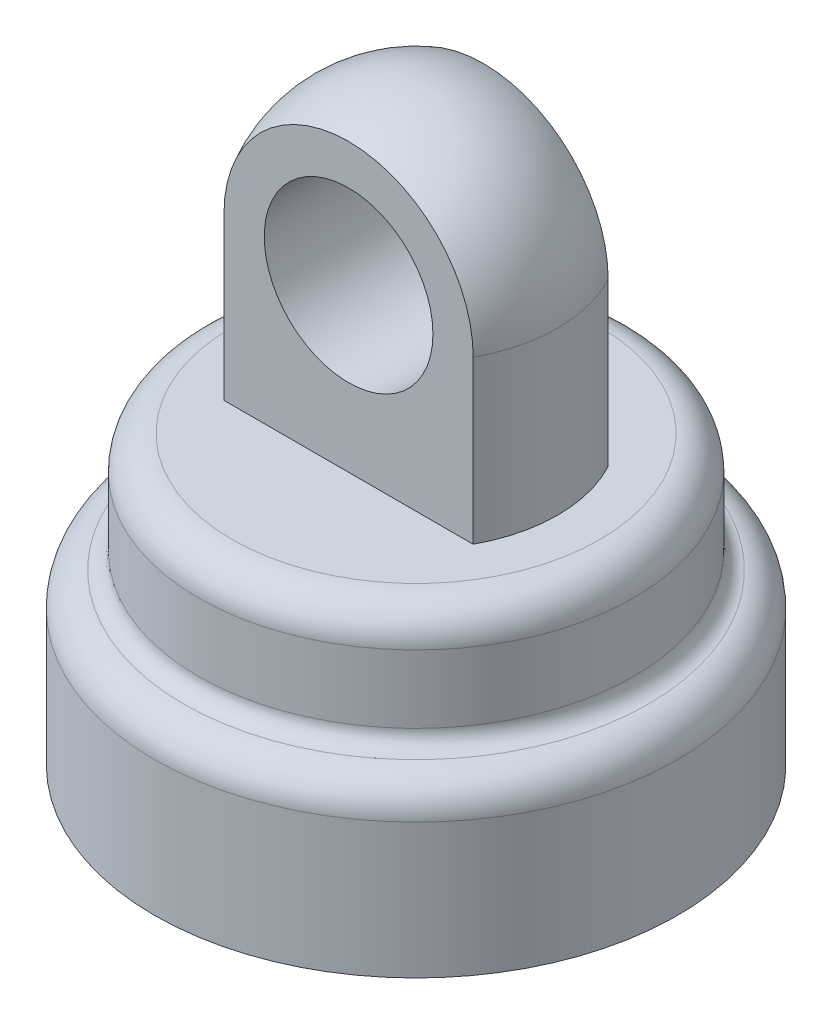
ISO-10303-21;
HEADER;
FILE_DESCRIPTION(('STEP AP214'),'2;1');
FILE_NAME('part.step','',(''),(''),'','','');
FILE_SCHEMA(('AUTOMOTIVE_DESIGN { 1 0 10303 214 1 1 1 1 }'));
ENDSEC;
DATA;
#1=APPLICATION_CONTEXT('core data for automotive mechanical design processes');
#2=APPLICATION_PROTOCOL_DEFINITION('international standard','automotive_design',2000,#1);
#3=PRODUCT_CONTEXT('',#1,'mechanical');
#4=PRODUCT('Part','Part','',(#3));
#5=PRODUCT_RELATED_PRODUCT_CATEGORY('part','',(#4));
#6=PRODUCT_DEFINITION_FORMATION('','',#4);
#7=PRODUCT_DEFINITION_CONTEXT('part definition',#1,'design');
#8=PRODUCT_DEFINITION('design','',#6,#7);
#9=PRODUCT_DEFINITION_SHAPE('','',#8);
#10=(LENGTH_UNIT() NAMED_UNIT(*) SI_UNIT(.MILLI.,.METRE.));
#11=(NAMED_UNIT(*) PLANE_ANGLE_UNIT() SI_UNIT($,.RADIAN.));
#12=(NAMED_UNIT(*) SI_UNIT($,.STERADIAN.) SOLID_ANGLE_UNIT());
#13=UNCERTAINTY_MEASURE_WITH_UNIT(LENGTH_MEASURE(1.E-05),#10,'distance_accuracy_value','');
#14=(GEOMETRIC_REPRESENTATION_CONTEXT(3) GLOBAL_UNCERTAINTY_ASSIGNED_CONTEXT((#13)) GLOBAL_UNIT_ASSIGNED_CONTEXT((#10,
#11,#12)) REPRESENTATION_CONTEXT('',''));
#15=CARTESIAN_POINT('',(0.,0.,0.));
#16=DIRECTION('',(0.,0.,1.));
#17=DIRECTION('',(1.,0.,0.));
#18=AXIS2_PLACEMENT_3D('',#15,#16,#17);
#19=CARTESIAN_POINT('',(0.,17.5,0.));
#20=DIRECTION('',(0.,-1.,0.));
#21=DIRECTION('',(0.,0.,-1.));
#22=AXIS2_PLACEMENT_3D('',#19,#20,#21);
#23=CYLINDRICAL_SURFACE('',#22,4.2);
#24=CARTESIAN_POINT('',(0.,13.3,0.));
#25=DIRECTION('',(0.,-1.,0.));
#26=DIRECTION('',(0.,0.,-1.));
#27=AXIS2_PLACEMENT_3D('',#24,#25,#26);
#28=CIRCLE('',#27,4.2);
#29=CARTESIAN_POINT('',(-3.69323706252388,13.3,2.));
#30=VERTEX_POINT('',#29);
#31=CARTESIAN_POINT('',(-3.69323706252388,13.3,-2.));
#32=VERTEX_POINT('',#31);
#33=EDGE_CURVE('E78',#30,#32,#28,.T.);
#34=ORIENTED_EDGE('',*,*,#33,.T.);
#35=DIRECTION('',(0.,-1.,0.));
#36=VECTOR('',#35,1.);
#37=CARTESIAN_POINT('',(-3.69323706252388,17.5,-2.));
#38=LINE('',#37,#36);
#39=CARTESIAN_POINT('',(-3.69323706252388,8.5,-2.));
#40=VERTEX_POINT('',#39);
#41=EDGE_CURVE('E31',#32,#40,#38,.T.);
#42=ORIENTED_EDGE('',*,*,#41,.T.);
#43=CARTESIAN_POINT('',(0.,8.5,0.));
#44=DIRECTION('',(0.,1.,0.));
#45=DIRECTION('',(0.,0.,1.));
#46=AXIS2_PLACEMENT_3D('',#43,#44,#45);
#47=CIRCLE('',#46,4.2);
#48=CARTESIAN_POINT('',(-3.69323706252388,8.5,2.));
#49=VERTEX_POINT('',#48);
#50=EDGE_CURVE('E70',#49,#40,#47,.F.);
#51=ORIENTED_EDGE('',*,*,#50,.F.);
#52=DIRECTION('',(0.,-1.,0.));
#53=VECTOR('',#52,1.);
#54=CARTESIAN_POINT('',(-3.69323706252388,17.5,2.));
#55=LINE('',#54,#53);
#56=EDGE_CURVE('E55',#49,#30,#55,.F.);
#57=ORIENTED_EDGE('',*,*,#56,.T.);
#58=EDGE_LOOP('',(#34,#42,#51,#57));
#59=FACE_BOUND('',#58,.T.);
#60=ADVANCED_FACE('F16',(#59),#23,.T.);
#61=CARTESIAN_POINT('',(0.,8.5,0.));
#62=DIRECTION('',(0.,1.,0.));
#63=DIRECTION('',(0.,0.,1.));
#64=AXIS2_PLACEMENT_3D('',#61,#62,#63);
#65=PLANE('',#64);
#66=CARTESIAN_POINT('',(0.,8.5,0.));
#67=DIRECTION('',(0.,1.,0.));
#68=DIRECTION('',(0.,0.,1.));
#69=AXIS2_PLACEMENT_3D('',#66,#67,#68);
#70=CIRCLE('',#69,5.45);
#71=CARTESIAN_POINT('',(0.,8.5,5.45));
#72=VERTEX_POINT('',#71);
#73=EDGE_CURVE('E91',#72,#72,#70,.T.);
#74=ORIENTED_EDGE('',*,*,#73,.T.);
#75=EDGE_LOOP('',(#74));
#76=FACE_BOUND('',#75,.T.);
#77=ORIENTED_EDGE('',*,*,#50,.T.);
#78=DIRECTION('',(-1.,0.,0.));
#79=VECTOR('',#78,1.);
#80=CARTESIAN_POINT('',(-5.,8.5,-2.));
#81=LINE('',#80,#79);
#82=CARTESIAN_POINT('',(3.69323706252388,8.5,-2.));
#83=VERTEX_POINT('',#82);
#84=EDGE_CURVE('E73',#83,#40,#81,.T.);
#85=ORIENTED_EDGE('',*,*,#84,.F.);
#86=CARTESIAN_POINT('',(3.69323706252388,8.5,2.));
#87=VERTEX_POINT('',#86);
#88=EDGE_CURVE('E72',#83,#87,#47,.F.);
#89=ORIENTED_EDGE('',*,*,#88,.T.);
#90=DIRECTION('',(1.,0.,0.));
#91=VECTOR('',#90,1.);
#92=CARTESIAN_POINT('',(-5.,8.5,2.));
#93=LINE('',#92,#91);
#94=EDGE_CURVE('E58',#49,#87,#93,.T.);
#95=ORIENTED_EDGE('',*,*,#94,.F.);
#96=EDGE_LOOP('',(#77,#85,#89,#95));
#97=FACE_BOUND('',#96,.T.);
#98=ADVANCED_FACE('F68',(#76,#97),#65,.T.);
#99=CARTESIAN_POINT('',(0.,5.,0.));
#100=DIRECTION('',(0.,-1.,0.));
#101=DIRECTION('',(0.,0.,-1.));
#102=AXIS2_PLACEMENT_3D('',#99,#100,#101);
#103=CYLINDRICAL_SURFACE('',#102,7.75);
#104=CARTESIAN_POINT('',(0.,4.,0.));
#105=DIRECTION('',(0.,1.,0.));
#106=DIRECTION('',(0.,0.,1.));
#107=AXIS2_PLACEMENT_3D('',#104,#105,#106);
#108=CIRCLE('',#107,7.75);
#109=CARTESIAN_POINT('',(0.,4.,7.75));
#110=VERTEX_POINT('',#109);
#111=EDGE_CURVE('E88',#110,#110,#108,.F.);
#112=ORIENTED_EDGE('',*,*,#111,.T.);
#113=EDGE_LOOP('',(#112));
#114=FACE_BOUND('',#113,.T.);
#115=CARTESIAN_POINT('',(0.,0.,0.));
#116=DIRECTION('',(0.,1.,0.));
#117=DIRECTION('',(0.,0.,1.));
#118=AXIS2_PLACEMENT_3D('',#115,#116,#117);
#119=CIRCLE('',#118,7.75);
#120=CARTESIAN_POINT('',(0.,0.,7.75));
#121=VERTEX_POINT('',#120);
#122=EDGE_CURVE('E75',#121,#121,#119,.T.);
#123=ORIENTED_EDGE('',*,*,#122,.T.);
#124=EDGE_LOOP('',(#123));
#125=FACE_BOUND('',#124,.T.);
#126=ADVANCED_FACE('F122',(#114,#125),#103,.T.);
#127=CARTESIAN_POINT('',(0.,0.,0.));
#128=DIRECTION('',(0.,1.,0.));
#129=DIRECTION('',(0.,0.,1.));
#130=AXIS2_PLACEMENT_3D('',#127,#128,#129);
#131=PLANE('',#130);
#132=CARTESIAN_POINT('',(0.,0.,0.));
#133=DIRECTION('',(0.,-1.,0.));
#134=DIRECTION('',(0.,0.,-1.));
#135=AXIS2_PLACEMENT_3D('',#132,#133,#134);
#136=CIRCLE('',#135,6.5);
#137=CARTESIAN_POINT('',(0.,0.,-6.5));
#138=VERTEX_POINT('',#137);
#139=EDGE_CURVE('E153',#138,#138,#136,.T.);
#140=ORIENTED_EDGE('',*,*,#139,.F.);
#141=EDGE_LOOP('',(#140));
#142=FACE_BOUND('',#141,.T.);
#143=ORIENTED_EDGE('',*,*,#122,.F.);
#144=EDGE_LOOP('',(#143));
#145=FACE_BOUND('',#144,.T.);
#146=ADVANCED_FACE('F136',(#142,#145),#131,.F.);
#147=CARTESIAN_POINT('',(0.,8.5,0.));
#148=DIRECTION('',(0.,-1.,0.));
#149=DIRECTION('',(0.,0.,-1.));
#150=AXIS2_PLACEMENT_3D('',#147,#148,#149);
#151=CYLINDRICAL_SURFACE('',#150,6.45);
#152=CARTESIAN_POINT('',(0.,5.48660687473185,0.));
#153=DIRECTION('',(0.,-1.,0.));
#154=DIRECTION('',(0.,0.,-1.));
#155=AXIS2_PLACEMENT_3D('',#152,#153,#154);
#156=CIRCLE('',#155,6.45);
#157=CARTESIAN_POINT('',(0.,5.48660687473185,-6.45));
#158=VERTEX_POINT('',#157);
#159=EDGE_CURVE('E11',#158,#158,#156,.F.);
#160=ORIENTED_EDGE('',*,*,#159,.T.);
#161=EDGE_LOOP('',(#160));
#162=FACE_BOUND('',#161,.T.);
#163=CARTESIAN_POINT('',(0.,7.5,0.));
#164=DIRECTION('',(0.,1.,0.));
#165=DIRECTION('',(0.,0.,1.));
#166=AXIS2_PLACEMENT_3D('',#163,#164,#165);
#167=CIRCLE('',#166,6.45);
#168=CARTESIAN_POINT('',(0.,7.5,6.45));
#169=VERTEX_POINT('',#168);
#170=EDGE_CURVE('E94',#169,#169,#167,.F.);
#171=ORIENTED_EDGE('',*,*,#170,.T.);
#172=EDGE_LOOP('',(#171));
#173=FACE_BOUND('',#172,.T.);
#174=ADVANCED_FACE('F128',(#162,#173),#151,.T.);
#175=ORIENTED_EDGE('',*,*,#88,.F.);
#176=DIRECTION('',(0.,-1.,0.));
#177=VECTOR('',#176,1.);
#178=CARTESIAN_POINT('',(3.69323706252388,17.5,-2.));
#179=LINE('',#178,#177);
#180=CARTESIAN_POINT('',(3.69323706252388,13.3,-2.));
#181=VERTEX_POINT('',#180);
#182=EDGE_CURVE('E140',#83,#181,#179,.F.);
#183=ORIENTED_EDGE('',*,*,#182,.T.);
#184=CARTESIAN_POINT('',(3.69323706252388,13.3,2.));
#185=VERTEX_POINT('',#184);
#186=EDGE_CURVE('E82',#181,#185,#28,.T.);
#187=ORIENTED_EDGE('',*,*,#186,.T.);
#188=DIRECTION('',(0.,-1.,0.));
#189=VECTOR('',#188,1.);
#190=CARTESIAN_POINT('',(3.69323706252388,17.5,2.));
#191=LINE('',#190,#189);
#192=EDGE_CURVE('E39',#185,#87,#191,.T.);
#193=ORIENTED_EDGE('',*,*,#192,.T.);
#194=EDGE_LOOP('',(#175,#183,#187,#193));
#195=FACE_BOUND('',#194,.T.);
#196=ADVANCED_FACE('F118',(#195),#23,.T.);
#197=CARTESIAN_POINT('',(0.,13.3,0.));
#198=DIRECTION('',(0.,0.,1.));
#199=DIRECTION('',(1.,0.,0.));
#200=AXIS2_PLACEMENT_3D('',#197,#198,#199);
#201=SPHERICAL_SURFACE('',#200,4.2);
#202=CARTESIAN_POINT('',(0.,13.3,-2.));
#203=DIRECTION('',(0.,0.,1.));
#204=DIRECTION('',(1.,0.,0.));
#205=AXIS2_PLACEMENT_3D('',#202,#203,#204);
#206=CIRCLE('',#205,3.69323706252388);
#207=EDGE_CURVE('E86',#32,#181,#206,.F.);
#208=ORIENTED_EDGE('',*,*,#207,.F.);
#209=ORIENTED_EDGE('',*,*,#33,.F.);
#210=CARTESIAN_POINT('',(0.,13.3,2.));
#211=DIRECTION('',(0.,0.,-1.));
#212=DIRECTION('',(-1.,0.,0.));
#213=AXIS2_PLACEMENT_3D('',#210,#211,#212);
#214=CIRCLE('',#213,3.69323706252388);
#215=EDGE_CURVE('E59',#185,#30,#214,.F.);
#216=ORIENTED_EDGE('',*,*,#215,.F.);
#217=ORIENTED_EDGE('',*,*,#186,.F.);
#218=EDGE_LOOP('',(#208,#209,#216,#217));
#219=FACE_BOUND('',#218,.T.);
#220=ADVANCED_FACE('F127',(#219),#201,.T.);
#221=CARTESIAN_POINT('',(-5.,17.,2.));
#222=DIRECTION('',(0.,0.,-1.));
#223=DIRECTION('',(-1.,0.,0.));
#224=AXIS2_PLACEMENT_3D('',#221,#222,#223);
#225=PLANE('',#224);
#226=CARTESIAN_POINT('',(0.,13.3,2.));
#227=DIRECTION('',(0.,0.,1.));
#228=DIRECTION('',(1.,0.,0.));
#229=AXIS2_PLACEMENT_3D('',#226,#227,#228);
#230=CIRCLE('',#229,2.5);
#231=CARTESIAN_POINT('',(2.5,13.3,2.));
#232=VERTEX_POINT('',#231);
#233=EDGE_CURVE('E149',#232,#232,#230,.T.);
#234=ORIENTED_EDGE('',*,*,#233,.F.);
#235=EDGE_LOOP('',(#234));
#236=FACE_BOUND('',#235,.T.);
#237=ORIENTED_EDGE('',*,*,#215,.T.);
#238=ORIENTED_EDGE('',*,*,#56,.F.);
#239=ORIENTED_EDGE('',*,*,#94,.T.);
#240=ORIENTED_EDGE('',*,*,#192,.F.);
#241=EDGE_LOOP('',(#237,#238,#239,#240));
#242=FACE_BOUND('',#241,.T.);
#243=ADVANCED_FACE('F57',(#236,#242),#225,.F.);
#244=CARTESIAN_POINT('',(-5.,17.,-2.));
#245=DIRECTION('',(0.,0.,1.));
#246=DIRECTION('',(1.,0.,0.));
#247=AXIS2_PLACEMENT_3D('',#244,#245,#246);
#248=PLANE('',#247);
#249=CARTESIAN_POINT('',(0.,13.3,-2.));
#250=DIRECTION('',(0.,0.,1.));
#251=DIRECTION('',(1.,0.,0.));
#252=AXIS2_PLACEMENT_3D('',#249,#250,#251);
#253=CIRCLE('',#252,2.5);
#254=CARTESIAN_POINT('',(2.5,13.3,-2.));
#255=VERTEX_POINT('',#254);
#256=EDGE_CURVE('E146',#255,#255,#253,.T.);
#257=ORIENTED_EDGE('',*,*,#256,.T.);
#258=EDGE_LOOP('',(#257));
#259=FACE_BOUND('',#258,.T.);
#260=ORIENTED_EDGE('',*,*,#207,.T.);
#261=ORIENTED_EDGE('',*,*,#182,.F.);
#262=ORIENTED_EDGE('',*,*,#84,.T.);
#263=ORIENTED_EDGE('',*,*,#41,.F.);
#264=EDGE_LOOP('',(#260,#261,#262,#263));
#265=FACE_BOUND('',#264,.T.);
#266=ADVANCED_FACE('F178',(#259,#265),#248,.F.);
#267=CARTESIAN_POINT('',(0.,13.3,2.));
#268=DIRECTION('',(0.,0.,1.));
#269=DIRECTION('',(1.,0.,0.));
#270=AXIS2_PLACEMENT_3D('',#267,#268,#269);
#271=CYLINDRICAL_SURFACE('',#270,2.5);
#272=ORIENTED_EDGE('',*,*,#233,.T.);
#273=EDGE_LOOP('',(#272));
#274=FACE_BOUND('',#273,.T.);
#275=ORIENTED_EDGE('',*,*,#256,.F.);
#276=EDGE_LOOP('',(#275));
#277=FACE_BOUND('',#276,.T.);
#278=ADVANCED_FACE('F174',(#274,#277),#271,.F.);
#279=CARTESIAN_POINT('',(0.,4.,0.));
#280=DIRECTION('',(0.,1.,0.));
#281=DIRECTION('',(0.,0.,1.));
#282=AXIS2_PLACEMENT_3D('',#279,#280,#281);
#283=TOROIDAL_SURFACE('',#282,6.75,1.);
#284=CARTESIAN_POINT('',(0.,4.99107124982072,0.));
#285=DIRECTION('',(0.,-1.,0.));
#286=DIRECTION('',(0.,0.,-1.));
#287=AXIS2_PLACEMENT_3D('',#284,#285,#286);
#288=CIRCLE('',#287,6.88333333333326);
#289=CARTESIAN_POINT('',(0.,4.99107124982072,-6.88333333333326));
#290=VERTEX_POINT('',#289);
#291=EDGE_CURVE('E24',#290,#290,#288,.T.);
#292=ORIENTED_EDGE('',*,*,#291,.T.);
#293=EDGE_LOOP('',(#292));
#294=FACE_BOUND('',#293,.T.);
#295=ORIENTED_EDGE('',*,*,#111,.F.);
#296=EDGE_LOOP('',(#295));
#297=FACE_BOUND('',#296,.T.);
#298=ADVANCED_FACE('F99',(#294,#297),#283,.T.);
#299=CARTESIAN_POINT('',(0.,7.5,0.));
#300=DIRECTION('',(0.,1.,0.));
#301=DIRECTION('',(0.,0.,1.));
#302=AXIS2_PLACEMENT_3D('',#299,#300,#301);
#303=TOROIDAL_SURFACE('',#302,5.45,1.);
#304=ORIENTED_EDGE('',*,*,#170,.F.);
#305=EDGE_LOOP('',(#304));
#306=FACE_BOUND('',#305,.T.);
#307=ORIENTED_EDGE('',*,*,#73,.F.);
#308=EDGE_LOOP('',(#307));
#309=FACE_BOUND('',#308,.T.);
#310=ADVANCED_FACE('F104',(#306,#309),#303,.T.);
#311=CARTESIAN_POINT('',(0.,5.48660687473185,0.));
#312=DIRECTION('',(0.,-1.,0.));
#313=DIRECTION('',(0.,0.,-1.));
#314=AXIS2_PLACEMENT_3D('',#311,#312,#313);
#315=TOROIDAL_SURFACE('',#314,6.95,0.5);
#316=ORIENTED_EDGE('',*,*,#159,.F.);
#317=EDGE_LOOP('',(#316));
#318=FACE_BOUND('',#317,.T.);
#319=ORIENTED_EDGE('',*,*,#291,.F.);
#320=EDGE_LOOP('',(#319));
#321=FACE_BOUND('',#320,.T.);
#322=ADVANCED_FACE('F18',(#318,#321),#315,.F.);
#323=CARTESIAN_POINT('',(0.,4.5,0.));
#324=DIRECTION('',(0.,-1.,0.));
#325=DIRECTION('',(0.,0.,-1.));
#326=AXIS2_PLACEMENT_3D('',#323,#324,#325);
#327=CYLINDRICAL_SURFACE('',#326,6.5);
#328=CARTESIAN_POINT('',(0.,4.5,0.));
#329=DIRECTION('',(0.,-1.,0.));
#330=DIRECTION('',(0.,0.,-1.));
#331=AXIS2_PLACEMENT_3D('',#328,#329,#330);
#332=CIRCLE('',#331,6.5);
#333=CARTESIAN_POINT('',(0.,4.5,-6.5));
#334=VERTEX_POINT('',#333);
#335=EDGE_CURVE('E152',#334,#334,#332,.T.);
#336=ORIENTED_EDGE('',*,*,#335,.F.);
#337=EDGE_LOOP('',(#336));
#338=FACE_BOUND('',#337,.T.);
#339=ORIENTED_EDGE('',*,*,#139,.T.);
#340=EDGE_LOOP('',(#339));
#341=FACE_BOUND('',#340,.T.);
#342=ADVANCED_FACE('F103',(#338,#341),#327,.F.);
#343=CARTESIAN_POINT('',(0.,4.5,0.));
#344=DIRECTION('',(0.,-1.,0.));
#345=DIRECTION('',(0.,0.,-1.));
#346=AXIS2_PLACEMENT_3D('',#343,#344,#345);
#347=PLANE('',#346);
#348=ORIENTED_EDGE('',*,*,#335,.T.);
#349=EDGE_LOOP('',(#348));
#350=FACE_BOUND('',#349,.T.);
#351=ADVANCED_FACE('F111',(#350),#347,.T.);
#352=CLOSED_SHELL('',(#60,#98,#126,#146,#174,#196,#220,#243,#266,#278,#298,#310,#322,#342,#351));
#353=MANIFOLD_SOLID_BREP('B1',#352);
#354=ADVANCED_BREP_SHAPE_REPRESENTATION('',(#18,#353),#14);
#355=SHAPE_DEFINITION_REPRESENTATION(#9,#354);
ENDSEC;
END-ISO-10303-21;
